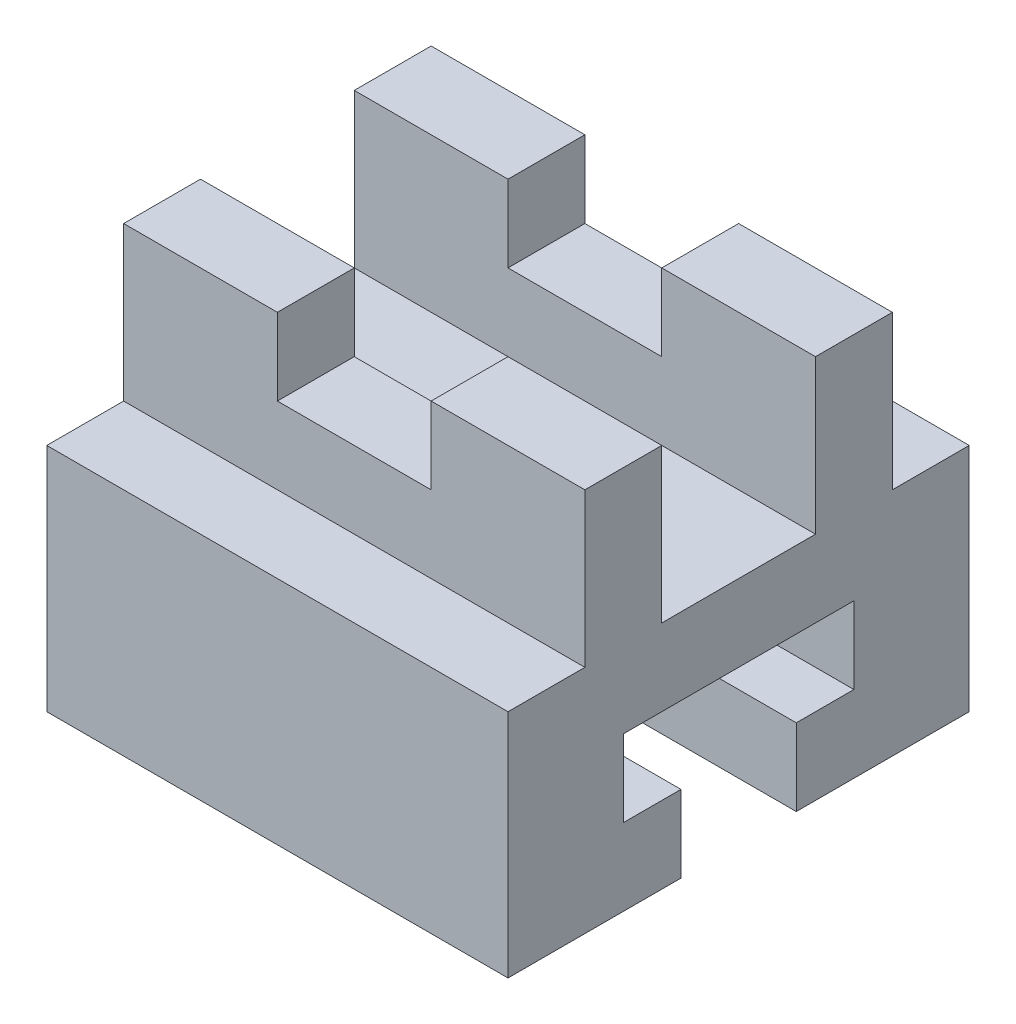
ISO-10303-21;
HEADER;
FILE_DESCRIPTION(('STEP AP214'),'2;1');
FILE_NAME('part.step','',(''),(''),'','','');
FILE_SCHEMA(('AUTOMOTIVE_DESIGN { 1 0 10303 214 1 1 1 1 }'));
ENDSEC;
DATA;
#1=APPLICATION_CONTEXT('core data for automotive mechanical design processes');
#2=APPLICATION_PROTOCOL_DEFINITION('international standard','automotive_design',2000,#1);
#3=PRODUCT_CONTEXT('',#1,'mechanical');
#4=PRODUCT('Part','Part','',(#3));
#5=PRODUCT_RELATED_PRODUCT_CATEGORY('part','',(#4));
#6=PRODUCT_DEFINITION_FORMATION('','',#4);
#7=PRODUCT_DEFINITION_CONTEXT('part definition',#1,'design');
#8=PRODUCT_DEFINITION('design','',#6,#7);
#9=PRODUCT_DEFINITION_SHAPE('','',#8);
#10=(LENGTH_UNIT() NAMED_UNIT(*) SI_UNIT(.MILLI.,.METRE.));
#11=(NAMED_UNIT(*) PLANE_ANGLE_UNIT() SI_UNIT($,.RADIAN.));
#12=(NAMED_UNIT(*) SI_UNIT($,.STERADIAN.) SOLID_ANGLE_UNIT());
#13=UNCERTAINTY_MEASURE_WITH_UNIT(LENGTH_MEASURE(1.E-05),#10,'distance_accuracy_value','');
#14=(GEOMETRIC_REPRESENTATION_CONTEXT(3) GLOBAL_UNCERTAINTY_ASSIGNED_CONTEXT((#13)) GLOBAL_UNIT_ASSIGNED_CONTEXT((#10,
#11,#12)) REPRESENTATION_CONTEXT('',''));
#15=CARTESIAN_POINT('',(0.,0.,0.));
#16=DIRECTION('',(0.,0.,1.));
#17=DIRECTION('',(1.,0.,0.));
#18=AXIS2_PLACEMENT_3D('',#15,#16,#17);
#19=CARTESIAN_POINT('',(32.7027027027027,39.7972972972973,60.));
#20=DIRECTION('',(0.,-1.,0.));
#21=DIRECTION('',(1.,0.,0.));
#22=AXIS2_PLACEMENT_3D('',#19,#20,#21);
#23=PLANE('',#22);
#24=DIRECTION('',(-1.,0.,0.));
#25=VECTOR('',#24,1.);
#26=CARTESIAN_POINT('',(32.7027027027027,39.7972972972973,50.));
#27=LINE('',#26,#25);
#28=CARTESIAN_POINT('',(-7.2972972972973,39.7972972972973,50.));
#29=VERTEX_POINT('',#28);
#30=CARTESIAN_POINT('',(-27.2972972972973,39.7972972972973,50.));
#31=VERTEX_POINT('',#30);
#32=EDGE_CURVE('E441',#29,#31,#27,.T.);
#33=ORIENTED_EDGE('',*,*,#32,.F.);
#34=DIRECTION('',(0.,0.,1.));
#35=VECTOR('',#34,1.);
#36=CARTESIAN_POINT('',(-7.2972972972973,39.7972972972973,9.99999999999999));
#37=LINE('',#36,#35);
#38=CARTESIAN_POINT('',(-7.2972972972973,39.7972972972973,40.));
#39=VERTEX_POINT('',#38);
#40=EDGE_CURVE('E265',#39,#29,#37,.T.);
#41=ORIENTED_EDGE('',*,*,#40,.F.);
#42=DIRECTION('',(-1.,0.,0.));
#43=VECTOR('',#42,1.);
#44=CARTESIAN_POINT('',(32.7027027027027,39.7972972972973,40.));
#45=LINE('',#44,#43);
#46=CARTESIAN_POINT('',(-27.2972972972973,39.7972972972973,40.));
#47=VERTEX_POINT('',#46);
#48=EDGE_CURVE('E314',#39,#47,#45,.T.);
#49=ORIENTED_EDGE('',*,*,#48,.T.);
#50=DIRECTION('',(0.,0.,-1.));
#51=VECTOR('',#50,1.);
#52=CARTESIAN_POINT('',(-27.2972972972973,39.7972972972973,60.));
#53=LINE('',#52,#51);
#54=EDGE_CURVE('E479',#31,#47,#53,.T.);
#55=ORIENTED_EDGE('',*,*,#54,.F.);
#56=EDGE_LOOP('',(#33,#41,#49,#55));
#57=FACE_BOUND('',#56,.T.);
#58=ADVANCED_FACE('F39',(#57),#23,.F.);
#59=DIRECTION('',(-1.,0.,0.));
#60=VECTOR('',#59,1.);
#61=CARTESIAN_POINT('',(32.7027027027027,39.7972972972973,20.));
#62=LINE('',#61,#60);
#63=CARTESIAN_POINT('',(-7.2972972972973,39.7972972972973,20.));
#64=VERTEX_POINT('',#63);
#65=CARTESIAN_POINT('',(-27.2972972972973,39.7972972972973,20.));
#66=VERTEX_POINT('',#65);
#67=EDGE_CURVE('E298',#64,#66,#62,.T.);
#68=ORIENTED_EDGE('',*,*,#67,.F.);
#69=CARTESIAN_POINT('',(-7.2972972972973,39.7972972972973,9.99999999999999));
#70=VERTEX_POINT('',#69);
#71=EDGE_CURVE('E261',#70,#64,#37,.T.);
#72=ORIENTED_EDGE('',*,*,#71,.F.);
#73=DIRECTION('',(-1.,0.,0.));
#74=VECTOR('',#73,1.);
#75=CARTESIAN_POINT('',(32.7027027027027,39.7972972972973,10.));
#76=LINE('',#75,#74);
#77=CARTESIAN_POINT('',(-27.2972972972973,39.7972972972973,10.));
#78=VERTEX_POINT('',#77);
#79=EDGE_CURVE('E245',#70,#78,#76,.T.);
#80=ORIENTED_EDGE('',*,*,#79,.T.);
#81=EDGE_CURVE('E468',#66,#78,#53,.T.);
#82=ORIENTED_EDGE('',*,*,#81,.F.);
#83=EDGE_LOOP('',(#68,#72,#80,#82));
#84=FACE_BOUND('',#83,.T.);
#85=ADVANCED_FACE('F625',(#84),#23,.F.);
#86=CARTESIAN_POINT('',(32.7027027027027,39.7972972972973,40.));
#87=VERTEX_POINT('',#86);
#88=CARTESIAN_POINT('',(12.7027027027027,39.7972972972973,40.));
#89=VERTEX_POINT('',#88);
#90=EDGE_CURVE('E309',#87,#89,#45,.T.);
#91=ORIENTED_EDGE('',*,*,#90,.T.);
#92=DIRECTION('',(0.,0.,1.));
#93=VECTOR('',#92,1.);
#94=CARTESIAN_POINT('',(12.7027027027027,39.7972972972973,9.99999999999999));
#95=LINE('',#94,#93);
#96=CARTESIAN_POINT('',(12.7027027027027,39.7972972972973,50.));
#97=VERTEX_POINT('',#96);
#98=EDGE_CURVE('E270',#89,#97,#95,.T.);
#99=ORIENTED_EDGE('',*,*,#98,.T.);
#100=CARTESIAN_POINT('',(32.7027027027027,39.7972972972973,50.));
#101=VERTEX_POINT('',#100);
#102=EDGE_CURVE('E453',#101,#97,#27,.T.);
#103=ORIENTED_EDGE('',*,*,#102,.F.);
#104=DIRECTION('',(0.,0.,-1.));
#105=VECTOR('',#104,1.);
#106=CARTESIAN_POINT('',(32.7027027027027,39.7972972972973,60.));
#107=LINE('',#106,#105);
#108=EDGE_CURVE('E484',#101,#87,#107,.T.);
#109=ORIENTED_EDGE('',*,*,#108,.T.);
#110=EDGE_LOOP('',(#91,#99,#103,#109));
#111=FACE_BOUND('',#110,.T.);
#112=ADVANCED_FACE('F558',(#111),#23,.F.);
#113=CARTESIAN_POINT('',(-27.2972972972973,-10.2027027027027,60.));
#114=DIRECTION('',(0.,1.,0.));
#115=DIRECTION('',(0.,0.,1.));
#116=AXIS2_PLACEMENT_3D('',#113,#114,#115);
#117=PLANE('',#116);
#118=DIRECTION('',(0.,0.,-1.));
#119=VECTOR('',#118,1.);
#120=CARTESIAN_POINT('',(-27.2972972972973,-10.2027027027027,60.));
#121=LINE('',#120,#119);
#122=CARTESIAN_POINT('',(-27.2972972972973,-10.2027027027027,60.));
#123=VERTEX_POINT('',#122);
#124=CARTESIAN_POINT('',(-27.2972972972973,-10.2027027027027,37.5));
#125=VERTEX_POINT('',#124);
#126=EDGE_CURVE('E494',#123,#125,#121,.T.);
#127=ORIENTED_EDGE('',*,*,#126,.T.);
#128=DIRECTION('',(1.,0.,0.));
#129=VECTOR('',#128,1.);
#130=CARTESIAN_POINT('',(-27.2972972972973,-10.2027027027027,37.5));
#131=LINE('',#130,#129);
#132=CARTESIAN_POINT('',(32.7027027027027,-10.2027027027027,37.5));
#133=VERTEX_POINT('',#132);
#134=EDGE_CURVE('E380',#125,#133,#131,.T.);
#135=ORIENTED_EDGE('',*,*,#134,.T.);
#136=DIRECTION('',(0.,0.,-1.));
#137=VECTOR('',#136,1.);
#138=CARTESIAN_POINT('',(32.7027027027027,-10.2027027027027,60.));
#139=LINE('',#138,#137);
#140=CARTESIAN_POINT('',(32.7027027027027,-10.2027027027027,60.));
#141=VERTEX_POINT('',#140);
#142=EDGE_CURVE('E489',#141,#133,#139,.T.);
#143=ORIENTED_EDGE('',*,*,#142,.F.);
#144=DIRECTION('',(1.,0.,0.));
#145=VECTOR('',#144,1.);
#146=CARTESIAN_POINT('',(-27.2972972972973,-10.2027027027027,60.));
#147=LINE('',#146,#145);
#148=EDGE_CURVE('E460',#123,#141,#147,.T.);
#149=ORIENTED_EDGE('',*,*,#148,.F.);
#150=EDGE_LOOP('',(#127,#135,#143,#149));
#151=FACE_BOUND('',#150,.T.);
#152=ADVANCED_FACE('F585',(#151),#117,.F.);
#153=CARTESIAN_POINT('',(-27.2972972972973,39.7972972972973,60.));
#154=DIRECTION('',(1.,0.,0.));
#155=DIRECTION('',(0.,1.,0.));
#156=AXIS2_PLACEMENT_3D('',#153,#154,#155);
#157=PLANE('',#156);
#158=ORIENTED_EDGE('',*,*,#54,.T.);
#159=DIRECTION('',(0.,1.,0.));
#160=VECTOR('',#159,1.);
#161=CARTESIAN_POINT('',(-27.2972972972973,19.7972972972973,40.));
#162=LINE('',#161,#160);
#163=CARTESIAN_POINT('',(-27.2972972972973,19.7972972972973,40.));
#164=VERTEX_POINT('',#163);
#165=EDGE_CURVE('E290',#164,#47,#162,.T.);
#166=ORIENTED_EDGE('',*,*,#165,.F.);
#167=DIRECTION('',(0.,0.,1.));
#168=VECTOR('',#167,1.);
#169=CARTESIAN_POINT('',(-27.2972972972973,19.7972972972973,20.));
#170=LINE('',#169,#168);
#171=CARTESIAN_POINT('',(-27.2972972972973,19.7972972972973,20.));
#172=VERTEX_POINT('',#171);
#173=EDGE_CURVE('E302',#172,#164,#170,.T.);
#174=ORIENTED_EDGE('',*,*,#173,.F.);
#175=DIRECTION('',(0.,-1.,0.));
#176=VECTOR('',#175,1.);
#177=CARTESIAN_POINT('',(-27.2972972972973,39.7972972972973,20.));
#178=LINE('',#177,#176);
#179=EDGE_CURVE('E284',#66,#172,#178,.T.);
#180=ORIENTED_EDGE('',*,*,#179,.F.);
#181=ORIENTED_EDGE('',*,*,#81,.T.);
#182=DIRECTION('',(0.,1.,0.));
#183=VECTOR('',#182,1.);
#184=CARTESIAN_POINT('',(-27.2972972972973,39.7972972972973,10.));
#185=LINE('',#184,#183);
#186=CARTESIAN_POINT('',(-27.2972972972973,19.7972972972973,10.));
#187=VERTEX_POINT('',#186);
#188=EDGE_CURVE('E410',#187,#78,#185,.T.);
#189=ORIENTED_EDGE('',*,*,#188,.F.);
#190=DIRECTION('',(0.,0.,1.));
#191=VECTOR('',#190,1.);
#192=CARTESIAN_POINT('',(-27.2972972972973,19.7972972972973,10.));
#193=LINE('',#192,#191);
#194=CARTESIAN_POINT('',(-27.2972972972973,19.7972972972973,0.));
#195=VERTEX_POINT('',#194);
#196=EDGE_CURVE('E415',#195,#187,#193,.T.);
#197=ORIENTED_EDGE('',*,*,#196,.F.);
#198=DIRECTION('',(0.,-1.,0.));
#199=VECTOR('',#198,1.);
#200=CARTESIAN_POINT('',(-27.2972972972973,39.7972972972973,0.));
#201=LINE('',#200,#199);
#202=CARTESIAN_POINT('',(-27.2972972972973,-10.2027027027027,0.));
#203=VERTEX_POINT('',#202);
#204=EDGE_CURVE('E426',#195,#203,#201,.T.);
#205=ORIENTED_EDGE('',*,*,#204,.T.);
#206=CARTESIAN_POINT('',(-27.2972972972973,-10.2027027027027,22.5));
#207=VERTEX_POINT('',#206);
#208=EDGE_CURVE('E493',#207,#203,#121,.T.);
#209=ORIENTED_EDGE('',*,*,#208,.F.);
#210=DIRECTION('',(0.,1.,0.));
#211=VECTOR('',#210,1.);
#212=CARTESIAN_POINT('',(-27.2972972972973,-0.2027027027027,22.5));
#213=LINE('',#212,#211);
#214=CARTESIAN_POINT('',(-27.2972972972973,-0.2027027027027,22.5));
#215=VERTEX_POINT('',#214);
#216=EDGE_CURVE('E325',#207,#215,#213,.T.);
#217=ORIENTED_EDGE('',*,*,#216,.T.);
#218=DIRECTION('',(0.,0.,-1.));
#219=VECTOR('',#218,1.);
#220=CARTESIAN_POINT('',(-27.2972972972973,-0.202702702702699,15.));
#221=LINE('',#220,#219);
#222=CARTESIAN_POINT('',(-27.2972972972973,-0.202702702702699,15.));
#223=VERTEX_POINT('',#222);
#224=EDGE_CURVE('E329',#215,#223,#221,.T.);
#225=ORIENTED_EDGE('',*,*,#224,.T.);
#226=DIRECTION('',(0.,1.,0.));
#227=VECTOR('',#226,1.);
#228=CARTESIAN_POINT('',(-27.2972972972973,9.7972972972973,15.));
#229=LINE('',#228,#227);
#230=CARTESIAN_POINT('',(-27.2972972972973,9.7972972972973,15.));
#231=VERTEX_POINT('',#230);
#232=EDGE_CURVE('E334',#223,#231,#229,.T.);
#233=ORIENTED_EDGE('',*,*,#232,.T.);
#234=DIRECTION('',(0.,0.,1.));
#235=VECTOR('',#234,1.);
#236=CARTESIAN_POINT('',(-27.2972972972973,9.7972972972973,45.));
#237=LINE('',#236,#235);
#238=CARTESIAN_POINT('',(-27.2972972972973,9.7972972972973,45.));
#239=VERTEX_POINT('',#238);
#240=EDGE_CURVE('E338',#231,#239,#237,.T.);
#241=ORIENTED_EDGE('',*,*,#240,.T.);
#242=DIRECTION('',(0.,-1.,0.));
#243=VECTOR('',#242,1.);
#244=CARTESIAN_POINT('',(-27.2972972972973,-0.202702702702702,45.));
#245=LINE('',#244,#243);
#246=CARTESIAN_POINT('',(-27.2972972972973,-0.202702702702702,45.));
#247=VERTEX_POINT('',#246);
#248=EDGE_CURVE('E342',#239,#247,#245,.T.);
#249=ORIENTED_EDGE('',*,*,#248,.T.);
#250=DIRECTION('',(0.,0.,-1.));
#251=VECTOR('',#250,1.);
#252=CARTESIAN_POINT('',(-27.2972972972973,-0.202702702702702,37.5));
#253=LINE('',#252,#251);
#254=CARTESIAN_POINT('',(-27.2972972972973,-0.202702702702702,37.5));
#255=VERTEX_POINT('',#254);
#256=EDGE_CURVE('E346',#247,#255,#253,.T.);
#257=ORIENTED_EDGE('',*,*,#256,.T.);
#258=DIRECTION('',(0.,-1.,0.));
#259=VECTOR('',#258,1.);
#260=CARTESIAN_POINT('',(-27.2972972972973,-10.2027027027027,37.5));
#261=LINE('',#260,#259);
#262=EDGE_CURVE('E350',#255,#125,#261,.T.);
#263=ORIENTED_EDGE('',*,*,#262,.T.);
#264=ORIENTED_EDGE('',*,*,#126,.F.);
#265=DIRECTION('',(0.,-1.,0.));
#266=VECTOR('',#265,1.);
#267=CARTESIAN_POINT('',(-27.2972972972973,39.7972972972973,60.));
#268=LINE('',#267,#266);
#269=CARTESIAN_POINT('',(-27.2972972972973,19.7972972972973,60.));
#270=VERTEX_POINT('',#269);
#271=EDGE_CURVE('E457',#270,#123,#268,.T.);
#272=ORIENTED_EDGE('',*,*,#271,.F.);
#273=DIRECTION('',(0.,0.,1.));
#274=VECTOR('',#273,1.);
#275=CARTESIAN_POINT('',(-27.2972972972973,19.7972972972973,50.));
#276=LINE('',#275,#274);
#277=CARTESIAN_POINT('',(-27.2972972972973,19.7972972972973,50.));
#278=VERTEX_POINT('',#277);
#279=EDGE_CURVE('E437',#278,#270,#276,.T.);
#280=ORIENTED_EDGE('',*,*,#279,.F.);
#281=DIRECTION('',(0.,-1.,0.));
#282=VECTOR('',#281,1.);
#283=CARTESIAN_POINT('',(-27.2972972972973,39.7972972972973,50.));
#284=LINE('',#283,#282);
#285=EDGE_CURVE('E384',#31,#278,#284,.T.);
#286=ORIENTED_EDGE('',*,*,#285,.F.);
#287=EDGE_LOOP('',(#158,#166,#174,#180,#181,#189,#197,#205,#209,#217,#225,#233,#241,#249,#257,
#263,#264,#272,#280,#286));
#288=FACE_BOUND('',#287,.T.);
#289=ADVANCED_FACE('F41',(#288),#157,.F.);
#290=CARTESIAN_POINT('',(32.7027027027027,-10.2027027027027,22.5));
#291=VERTEX_POINT('',#290);
#292=CARTESIAN_POINT('',(32.7027027027027,-10.2027027027027,0.));
#293=VERTEX_POINT('',#292);
#294=EDGE_CURVE('E488',#291,#293,#139,.T.);
#295=ORIENTED_EDGE('',*,*,#294,.F.);
#296=DIRECTION('',(1.,0.,0.));
#297=VECTOR('',#296,1.);
#298=CARTESIAN_POINT('',(-27.2972972972973,-10.2027027027027,22.5));
#299=LINE('',#298,#297);
#300=EDGE_CURVE('E354',#207,#291,#299,.T.);
#301=ORIENTED_EDGE('',*,*,#300,.F.);
#302=ORIENTED_EDGE('',*,*,#208,.T.);
#303=DIRECTION('',(1.,0.,0.));
#304=VECTOR('',#303,1.);
#305=CARTESIAN_POINT('',(-27.2972972972973,-10.2027027027027,0.));
#306=LINE('',#305,#304);
#307=EDGE_CURVE('E472',#203,#293,#306,.T.);
#308=ORIENTED_EDGE('',*,*,#307,.T.);
#309=EDGE_LOOP('',(#295,#301,#302,#308));
#310=FACE_BOUND('',#309,.T.);
#311=ADVANCED_FACE('F614',(#310),#117,.F.);
#312=CARTESIAN_POINT('',(32.7027027027027,-10.2027027027027,60.));
#313=DIRECTION('',(-1.,0.,0.));
#314=DIRECTION('',(0.,0.,1.));
#315=AXIS2_PLACEMENT_3D('',#312,#313,#314);
#316=PLANE('',#315);
#317=DIRECTION('',(0.,0.,1.));
#318=VECTOR('',#317,1.);
#319=CARTESIAN_POINT('',(32.7027027027027,19.7972972972973,20.));
#320=LINE('',#319,#318);
#321=CARTESIAN_POINT('',(32.7027027027027,19.7972972972973,20.));
#322=VERTEX_POINT('',#321);
#323=CARTESIAN_POINT('',(32.7027027027027,19.7972972972973,40.));
#324=VERTEX_POINT('',#323);
#325=EDGE_CURVE('E289',#322,#324,#320,.T.);
#326=ORIENTED_EDGE('',*,*,#325,.T.);
#327=DIRECTION('',(0.,1.,0.));
#328=VECTOR('',#327,1.);
#329=CARTESIAN_POINT('',(32.7027027027027,19.7972972972973,40.));
#330=LINE('',#329,#328);
#331=EDGE_CURVE('E294',#324,#87,#330,.T.);
#332=ORIENTED_EDGE('',*,*,#331,.T.);
#333=ORIENTED_EDGE('',*,*,#108,.F.);
#334=DIRECTION('',(0.,-1.,0.));
#335=VECTOR('',#334,1.);
#336=CARTESIAN_POINT('',(32.7027027027027,39.7972972972973,50.));
#337=LINE('',#336,#335);
#338=CARTESIAN_POINT('',(32.7027027027027,19.7972972972973,50.));
#339=VERTEX_POINT('',#338);
#340=EDGE_CURVE('E432',#101,#339,#337,.T.);
#341=ORIENTED_EDGE('',*,*,#340,.T.);
#342=DIRECTION('',(0.,0.,1.));
#343=VECTOR('',#342,1.);
#344=CARTESIAN_POINT('',(32.7027027027027,19.7972972972973,50.));
#345=LINE('',#344,#343);
#346=CARTESIAN_POINT('',(32.7027027027027,19.7972972972973,60.));
#347=VERTEX_POINT('',#346);
#348=EDGE_CURVE('E436',#339,#347,#345,.T.);
#349=ORIENTED_EDGE('',*,*,#348,.T.);
#350=DIRECTION('',(0.,1.,0.));
#351=VECTOR('',#350,1.);
#352=CARTESIAN_POINT('',(32.7027027027027,-10.2027027027027,60.));
#353=LINE('',#352,#351);
#354=EDGE_CURVE('E464',#141,#347,#353,.T.);
#355=ORIENTED_EDGE('',*,*,#354,.F.);
#356=ORIENTED_EDGE('',*,*,#142,.T.);
#357=DIRECTION('',(0.,-1.,0.));
#358=VECTOR('',#357,1.);
#359=CARTESIAN_POINT('',(32.7027027027027,-10.2027027027027,37.5));
#360=LINE('',#359,#358);
#361=CARTESIAN_POINT('',(32.7027027027027,-0.202702702702702,37.5));
#362=VERTEX_POINT('',#361);
#363=EDGE_CURVE('E330',#362,#133,#360,.T.);
#364=ORIENTED_EDGE('',*,*,#363,.F.);
#365=DIRECTION('',(0.,0.,-1.));
#366=VECTOR('',#365,1.);
#367=CARTESIAN_POINT('',(32.7027027027027,-0.202702702702702,37.5));
#368=LINE('',#367,#366);
#369=CARTESIAN_POINT('',(32.7027027027027,-0.202702702702702,45.));
#370=VERTEX_POINT('',#369);
#371=EDGE_CURVE('E374',#370,#362,#368,.T.);
#372=ORIENTED_EDGE('',*,*,#371,.F.);
#373=DIRECTION('',(0.,-1.,0.));
#374=VECTOR('',#373,1.);
#375=CARTESIAN_POINT('',(32.7027027027027,-0.202702702702702,45.));
#376=LINE('',#375,#374);
#377=CARTESIAN_POINT('',(32.7027027027027,9.7972972972973,45.));
#378=VERTEX_POINT('',#377);
#379=EDGE_CURVE('E370',#378,#370,#376,.T.);
#380=ORIENTED_EDGE('',*,*,#379,.F.);
#381=DIRECTION('',(0.,0.,1.));
#382=VECTOR('',#381,1.);
#383=CARTESIAN_POINT('',(32.7027027027027,9.7972972972973,45.));
#384=LINE('',#383,#382);
#385=CARTESIAN_POINT('',(32.7027027027027,9.7972972972973,15.));
#386=VERTEX_POINT('',#385);
#387=EDGE_CURVE('E366',#386,#378,#384,.T.);
#388=ORIENTED_EDGE('',*,*,#387,.F.);
#389=DIRECTION('',(0.,1.,0.));
#390=VECTOR('',#389,1.);
#391=CARTESIAN_POINT('',(32.7027027027027,9.7972972972973,15.));
#392=LINE('',#391,#390);
#393=CARTESIAN_POINT('',(32.7027027027027,-0.202702702702699,15.));
#394=VERTEX_POINT('',#393);
#395=EDGE_CURVE('E362',#394,#386,#392,.T.);
#396=ORIENTED_EDGE('',*,*,#395,.F.);
#397=DIRECTION('',(0.,0.,-1.));
#398=VECTOR('',#397,1.);
#399=CARTESIAN_POINT('',(32.7027027027027,-0.202702702702699,15.));
#400=LINE('',#399,#398);
#401=CARTESIAN_POINT('',(32.7027027027027,-0.2027027027027,22.5));
#402=VERTEX_POINT('',#401);
#403=EDGE_CURVE('E358',#402,#394,#400,.T.);
#404=ORIENTED_EDGE('',*,*,#403,.F.);
#405=DIRECTION('',(0.,1.,0.));
#406=VECTOR('',#405,1.);
#407=CARTESIAN_POINT('',(32.7027027027027,-0.2027027027027,22.5));
#408=LINE('',#407,#406);
#409=EDGE_CURVE('E313',#291,#402,#408,.T.);
#410=ORIENTED_EDGE('',*,*,#409,.F.);
#411=ORIENTED_EDGE('',*,*,#294,.T.);
#412=DIRECTION('',(0.,1.,0.));
#413=VECTOR('',#412,1.);
#414=CARTESIAN_POINT('',(32.7027027027027,-10.2027027027027,0.));
#415=LINE('',#414,#413);
#416=CARTESIAN_POINT('',(32.7027027027027,19.7972972972973,0.));
#417=VERTEX_POINT('',#416);
#418=EDGE_CURVE('E461',#293,#417,#415,.T.);
#419=ORIENTED_EDGE('',*,*,#418,.T.);
#420=DIRECTION('',(0.,0.,1.));
#421=VECTOR('',#420,1.);
#422=CARTESIAN_POINT('',(32.7027027027027,19.7972972972973,10.));
#423=LINE('',#422,#421);
#424=CARTESIAN_POINT('',(32.7027027027027,19.7972972972973,10.));
#425=VERTEX_POINT('',#424);
#426=EDGE_CURVE('E405',#417,#425,#423,.T.);
#427=ORIENTED_EDGE('',*,*,#426,.T.);
#428=DIRECTION('',(0.,1.,0.));
#429=VECTOR('',#428,1.);
#430=CARTESIAN_POINT('',(32.7027027027027,39.7972972972973,10.));
#431=LINE('',#430,#429);
#432=CARTESIAN_POINT('',(32.7027027027027,39.7972972972973,10.));
#433=VERTEX_POINT('',#432);
#434=EDGE_CURVE('E409',#425,#433,#431,.T.);
#435=ORIENTED_EDGE('',*,*,#434,.T.);
#436=CARTESIAN_POINT('',(32.7027027027027,39.7972972972973,20.));
#437=VERTEX_POINT('',#436);
#438=EDGE_CURVE('E483',#437,#433,#107,.T.);
#439=ORIENTED_EDGE('',*,*,#438,.F.);
#440=DIRECTION('',(0.,-1.,0.));
#441=VECTOR('',#440,1.);
#442=CARTESIAN_POINT('',(32.7027027027027,39.7972972972973,20.));
#443=LINE('',#442,#441);
#444=EDGE_CURVE('E285',#437,#322,#443,.T.);
#445=ORIENTED_EDGE('',*,*,#444,.T.);
#446=EDGE_LOOP('',(#326,#332,#333,#341,#349,#355,#356,#364,#372,#380,#388,#396,#404,#410,#411,
#419,#427,#435,#439,#445));
#447=FACE_BOUND('',#446,.T.);
#448=ADVANCED_FACE('F513',(#447),#316,.F.);
#449=CARTESIAN_POINT('',(12.7027027027027,39.7972972972973,9.99999999999999));
#450=VERTEX_POINT('',#449);
#451=EDGE_CURVE('E422',#433,#450,#76,.T.);
#452=ORIENTED_EDGE('',*,*,#451,.T.);
#453=CARTESIAN_POINT('',(12.7027027027027,39.7972972972973,20.));
#454=VERTEX_POINT('',#453);
#455=EDGE_CURVE('E266',#450,#454,#95,.T.);
#456=ORIENTED_EDGE('',*,*,#455,.T.);
#457=EDGE_CURVE('E321',#437,#454,#62,.T.);
#458=ORIENTED_EDGE('',*,*,#457,.F.);
#459=ORIENTED_EDGE('',*,*,#438,.T.);
#460=EDGE_LOOP('',(#452,#456,#458,#459));
#461=FACE_BOUND('',#460,.T.);
#462=ADVANCED_FACE('F508',(#461),#23,.F.);
#463=CARTESIAN_POINT('',(0.,0.,60.));
#464=DIRECTION('',(0.,0.,1.));
#465=DIRECTION('',(1.,0.,0.));
#466=AXIS2_PLACEMENT_3D('',#463,#464,#465);
#467=PLANE('',#466);
#468=DIRECTION('',(-1.,0.,0.));
#469=VECTOR('',#468,1.);
#470=CARTESIAN_POINT('',(32.7027027027027,19.7972972972973,60.));
#471=LINE('',#470,#469);
#472=EDGE_CURVE('E419',#347,#270,#471,.T.);
#473=ORIENTED_EDGE('',*,*,#472,.T.);
#474=ORIENTED_EDGE('',*,*,#271,.T.);
#475=ORIENTED_EDGE('',*,*,#148,.T.);
#476=ORIENTED_EDGE('',*,*,#354,.T.);
#477=EDGE_LOOP('',(#473,#474,#475,#476));
#478=FACE_BOUND('',#477,.T.);
#479=ADVANCED_FACE('F578',(#478),#467,.T.);
#480=CARTESIAN_POINT('',(0.,0.,0.));
#481=DIRECTION('',(0.,0.,1.));
#482=DIRECTION('',(1.,0.,0.));
#483=AXIS2_PLACEMENT_3D('',#480,#481,#482);
#484=PLANE('',#483);
#485=ORIENTED_EDGE('',*,*,#204,.F.);
#486=DIRECTION('',(-1.,0.,0.));
#487=VECTOR('',#486,1.);
#488=CARTESIAN_POINT('',(32.7027027027027,19.7972972972973,0.));
#489=LINE('',#488,#487);
#490=EDGE_CURVE('E414',#417,#195,#489,.T.);
#491=ORIENTED_EDGE('',*,*,#490,.F.);
#492=ORIENTED_EDGE('',*,*,#418,.F.);
#493=ORIENTED_EDGE('',*,*,#307,.F.);
#494=EDGE_LOOP('',(#485,#491,#492,#493));
#495=FACE_BOUND('',#494,.T.);
#496=ADVANCED_FACE('F521',(#495),#484,.F.);
#497=CARTESIAN_POINT('',(32.7027027027027,39.7972972972973,10.));
#498=DIRECTION('',(0.,0.,1.));
#499=DIRECTION('',(0.,-1.,0.));
#500=AXIS2_PLACEMENT_3D('',#497,#498,#499);
#501=PLANE('',#500);
#502=ORIENTED_EDGE('',*,*,#79,.F.);
#503=DIRECTION('',(0.,-1.,0.));
#504=VECTOR('',#503,1.);
#505=CARTESIAN_POINT('',(-7.2972972972973,29.7972972972973,9.99999999999999));
#506=LINE('',#505,#504);
#507=CARTESIAN_POINT('',(-7.2972972972973,29.7972972972973,9.99999999999999));
#508=VERTEX_POINT('',#507);
#509=EDGE_CURVE('E225',#70,#508,#506,.T.);
#510=ORIENTED_EDGE('',*,*,#509,.T.);
#511=DIRECTION('',(1.,0.,0.));
#512=VECTOR('',#511,1.);
#513=CARTESIAN_POINT('',(12.7027027027027,29.7972972972973,9.99999999999999));
#514=LINE('',#513,#512);
#515=CARTESIAN_POINT('',(12.7027027027027,29.7972972972973,9.99999999999999));
#516=VERTEX_POINT('',#515);
#517=EDGE_CURVE('E232',#508,#516,#514,.T.);
#518=ORIENTED_EDGE('',*,*,#517,.T.);
#519=DIRECTION('',(0.,1.,0.));
#520=VECTOR('',#519,1.);
#521=CARTESIAN_POINT('',(12.7027027027027,39.7972972972973,9.99999999999999));
#522=LINE('',#521,#520);
#523=EDGE_CURVE('E240',#516,#450,#522,.T.);
#524=ORIENTED_EDGE('',*,*,#523,.T.);
#525=ORIENTED_EDGE('',*,*,#451,.F.);
#526=ORIENTED_EDGE('',*,*,#434,.F.);
#527=DIRECTION('',(-1.,0.,0.));
#528=VECTOR('',#527,1.);
#529=CARTESIAN_POINT('',(32.7027027027027,19.7972972972973,10.));
#530=LINE('',#529,#528);
#531=EDGE_CURVE('E427',#425,#187,#530,.T.);
#532=ORIENTED_EDGE('',*,*,#531,.T.);
#533=ORIENTED_EDGE('',*,*,#188,.T.);
#534=EDGE_LOOP('',(#502,#510,#518,#524,#525,#526,#532,#533));
#535=FACE_BOUND('',#534,.T.);
#536=ADVANCED_FACE('F243',(#535),#501,.F.);
#537=CARTESIAN_POINT('',(32.7027027027027,19.7972972972973,10.));
#538=DIRECTION('',(0.,-1.,0.));
#539=DIRECTION('',(0.,0.,-1.));
#540=AXIS2_PLACEMENT_3D('',#537,#538,#539);
#541=PLANE('',#540);
#542=ORIENTED_EDGE('',*,*,#196,.T.);
#543=ORIENTED_EDGE('',*,*,#531,.F.);
#544=ORIENTED_EDGE('',*,*,#426,.F.);
#545=ORIENTED_EDGE('',*,*,#490,.T.);
#546=EDGE_LOOP('',(#542,#543,#544,#545));
#547=FACE_BOUND('',#546,.T.);
#548=ADVANCED_FACE('F517',(#547),#541,.F.);
#549=CARTESIAN_POINT('',(32.7027027027027,19.7972972972973,50.));
#550=DIRECTION('',(0.,-1.,0.));
#551=DIRECTION('',(1.,0.,0.));
#552=AXIS2_PLACEMENT_3D('',#549,#550,#551);
#553=PLANE('',#552);
#554=ORIENTED_EDGE('',*,*,#279,.T.);
#555=ORIENTED_EDGE('',*,*,#472,.F.);
#556=ORIENTED_EDGE('',*,*,#348,.F.);
#557=DIRECTION('',(-1.,0.,0.));
#558=VECTOR('',#557,1.);
#559=CARTESIAN_POINT('',(32.7027027027027,19.7972972972973,50.));
#560=LINE('',#559,#558);
#561=EDGE_CURVE('E450',#339,#278,#560,.T.);
#562=ORIENTED_EDGE('',*,*,#561,.T.);
#563=EDGE_LOOP('',(#554,#555,#556,#562));
#564=FACE_BOUND('',#563,.T.);
#565=ADVANCED_FACE('F576',(#564),#553,.F.);
#566=CARTESIAN_POINT('',(32.7027027027027,39.7972972972973,50.));
#567=DIRECTION('',(0.,0.,-1.));
#568=DIRECTION('',(-1.,0.,0.));
#569=AXIS2_PLACEMENT_3D('',#566,#567,#568);
#570=PLANE('',#569);
#571=DIRECTION('',(1.,0.,0.));
#572=VECTOR('',#571,1.);
#573=CARTESIAN_POINT('',(12.7027027027027,29.7972972972973,50.));
#574=LINE('',#573,#572);
#575=CARTESIAN_POINT('',(-7.2972972972973,29.7972972972973,50.));
#576=VERTEX_POINT('',#575);
#577=CARTESIAN_POINT('',(12.7027027027027,29.7972972972973,50.));
#578=VERTEX_POINT('',#577);
#579=EDGE_CURVE('E250',#576,#578,#574,.T.);
#580=ORIENTED_EDGE('',*,*,#579,.F.);
#581=DIRECTION('',(0.,-1.,0.));
#582=VECTOR('',#581,1.);
#583=CARTESIAN_POINT('',(-7.2972972972973,29.7972972972973,50.));
#584=LINE('',#583,#582);
#585=EDGE_CURVE('E255',#29,#576,#584,.T.);
#586=ORIENTED_EDGE('',*,*,#585,.F.);
#587=ORIENTED_EDGE('',*,*,#32,.T.);
#588=ORIENTED_EDGE('',*,*,#285,.T.);
#589=ORIENTED_EDGE('',*,*,#561,.F.);
#590=ORIENTED_EDGE('',*,*,#340,.F.);
#591=ORIENTED_EDGE('',*,*,#102,.T.);
#592=DIRECTION('',(0.,1.,0.));
#593=VECTOR('',#592,1.);
#594=CARTESIAN_POINT('',(12.7027027027027,39.7972972972973,50.));
#595=LINE('',#594,#593);
#596=EDGE_CURVE('E247',#578,#97,#595,.T.);
#597=ORIENTED_EDGE('',*,*,#596,.F.);
#598=EDGE_LOOP('',(#580,#586,#587,#588,#589,#590,#591,#597));
#599=FACE_BOUND('',#598,.T.);
#600=ADVANCED_FACE('F553',(#599),#570,.F.);
#601=CARTESIAN_POINT('',(-27.2972972972973,-10.2027027027027,37.5));
#602=DIRECTION('',(0.,0.,1.));
#603=DIRECTION('',(1.,0.,0.));
#604=AXIS2_PLACEMENT_3D('',#601,#602,#603);
#605=PLANE('',#604);
#606=ORIENTED_EDGE('',*,*,#363,.T.);
#607=ORIENTED_EDGE('',*,*,#134,.F.);
#608=ORIENTED_EDGE('',*,*,#262,.F.);
#609=DIRECTION('',(1.,0.,0.));
#610=VECTOR('',#609,1.);
#611=CARTESIAN_POINT('',(-27.2972972972973,-0.202702702702702,37.5));
#612=LINE('',#611,#610);
#613=EDGE_CURVE('E385',#255,#362,#612,.T.);
#614=ORIENTED_EDGE('',*,*,#613,.T.);
#615=EDGE_LOOP('',(#606,#607,#608,#614));
#616=FACE_BOUND('',#615,.T.);
#617=ADVANCED_FACE('F588',(#616),#605,.F.);
#618=CARTESIAN_POINT('',(-27.2972972972973,-0.202702702702702,37.5));
#619=DIRECTION('',(0.,-1.,0.));
#620=DIRECTION('',(0.,0.,-1.));
#621=AXIS2_PLACEMENT_3D('',#618,#619,#620);
#622=PLANE('',#621);
#623=ORIENTED_EDGE('',*,*,#371,.T.);
#624=ORIENTED_EDGE('',*,*,#613,.F.);
#625=ORIENTED_EDGE('',*,*,#256,.F.);
#626=DIRECTION('',(1.,0.,0.));
#627=VECTOR('',#626,1.);
#628=CARTESIAN_POINT('',(-27.2972972972973,-0.202702702702702,45.));
#629=LINE('',#628,#627);
#630=EDGE_CURVE('E388',#247,#370,#629,.T.);
#631=ORIENTED_EDGE('',*,*,#630,.T.);
#632=EDGE_LOOP('',(#623,#624,#625,#631));
#633=FACE_BOUND('',#632,.T.);
#634=ADVANCED_FACE('F592',(#633),#622,.F.);
#635=CARTESIAN_POINT('',(-27.2972972972973,-0.202702702702702,45.));
#636=DIRECTION('',(0.,0.,1.));
#637=DIRECTION('',(1.,0.,0.));
#638=AXIS2_PLACEMENT_3D('',#635,#636,#637);
#639=PLANE('',#638);
#640=ORIENTED_EDGE('',*,*,#379,.T.);
#641=ORIENTED_EDGE('',*,*,#630,.F.);
#642=ORIENTED_EDGE('',*,*,#248,.F.);
#643=DIRECTION('',(1.,0.,0.));
#644=VECTOR('',#643,1.);
#645=CARTESIAN_POINT('',(-27.2972972972973,9.7972972972973,45.));
#646=LINE('',#645,#644);
#647=EDGE_CURVE('E391',#239,#378,#646,.T.);
#648=ORIENTED_EDGE('',*,*,#647,.T.);
#649=EDGE_LOOP('',(#640,#641,#642,#648));
#650=FACE_BOUND('',#649,.T.);
#651=ADVANCED_FACE('F597',(#650),#639,.F.);
#652=CARTESIAN_POINT('',(-27.2972972972973,9.7972972972973,45.));
#653=DIRECTION('',(0.,1.,0.));
#654=DIRECTION('',(0.,0.,1.));
#655=AXIS2_PLACEMENT_3D('',#652,#653,#654);
#656=PLANE('',#655);
#657=ORIENTED_EDGE('',*,*,#387,.T.);
#658=ORIENTED_EDGE('',*,*,#647,.F.);
#659=ORIENTED_EDGE('',*,*,#240,.F.);
#660=DIRECTION('',(1.,0.,0.));
#661=VECTOR('',#660,1.);
#662=CARTESIAN_POINT('',(-27.2972972972973,9.7972972972973,15.));
#663=LINE('',#662,#661);
#664=EDGE_CURVE('E394',#231,#386,#663,.T.);
#665=ORIENTED_EDGE('',*,*,#664,.T.);
#666=EDGE_LOOP('',(#657,#658,#659,#665));
#667=FACE_BOUND('',#666,.T.);
#668=ADVANCED_FACE('F600',(#667),#656,.F.);
#669=CARTESIAN_POINT('',(-27.2972972972973,9.7972972972973,15.));
#670=DIRECTION('',(0.,0.,-1.));
#671=DIRECTION('',(0.,1.,0.));
#672=AXIS2_PLACEMENT_3D('',#669,#670,#671);
#673=PLANE('',#672);
#674=ORIENTED_EDGE('',*,*,#395,.T.);
#675=ORIENTED_EDGE('',*,*,#664,.F.);
#676=ORIENTED_EDGE('',*,*,#232,.F.);
#677=DIRECTION('',(1.,0.,0.));
#678=VECTOR('',#677,1.);
#679=CARTESIAN_POINT('',(-27.2972972972973,-0.202702702702699,15.));
#680=LINE('',#679,#678);
#681=EDGE_CURVE('E397',#223,#394,#680,.T.);
#682=ORIENTED_EDGE('',*,*,#681,.T.);
#683=EDGE_LOOP('',(#674,#675,#676,#682));
#684=FACE_BOUND('',#683,.T.);
#685=ADVANCED_FACE('F603',(#684),#673,.F.);
#686=CARTESIAN_POINT('',(-27.2972972972973,-0.202702702702699,15.));
#687=DIRECTION('',(0.,-1.,0.));
#688=DIRECTION('',(0.,0.,-1.));
#689=AXIS2_PLACEMENT_3D('',#686,#687,#688);
#690=PLANE('',#689);
#691=ORIENTED_EDGE('',*,*,#403,.T.);
#692=ORIENTED_EDGE('',*,*,#681,.F.);
#693=ORIENTED_EDGE('',*,*,#224,.F.);
#694=DIRECTION('',(1.,0.,0.));
#695=VECTOR('',#694,1.);
#696=CARTESIAN_POINT('',(-27.2972972972973,-0.2027027027027,22.5));
#697=LINE('',#696,#695);
#698=EDGE_CURVE('E400',#215,#402,#697,.T.);
#699=ORIENTED_EDGE('',*,*,#698,.T.);
#700=EDGE_LOOP('',(#691,#692,#693,#699));
#701=FACE_BOUND('',#700,.T.);
#702=ADVANCED_FACE('F608',(#701),#690,.F.);
#703=CARTESIAN_POINT('',(-27.2972972972973,-0.2027027027027,22.5));
#704=DIRECTION('',(0.,0.,-1.));
#705=DIRECTION('',(-1.,0.,0.));
#706=AXIS2_PLACEMENT_3D('',#703,#704,#705);
#707=PLANE('',#706);
#708=ORIENTED_EDGE('',*,*,#409,.T.);
#709=ORIENTED_EDGE('',*,*,#698,.F.);
#710=ORIENTED_EDGE('',*,*,#216,.F.);
#711=ORIENTED_EDGE('',*,*,#300,.T.);
#712=EDGE_LOOP('',(#708,#709,#710,#711));
#713=FACE_BOUND('',#712,.T.);
#714=ADVANCED_FACE('F611',(#713),#707,.F.);
#715=CARTESIAN_POINT('',(32.7027027027027,19.7972972972973,40.));
#716=DIRECTION('',(0.,0.,1.));
#717=DIRECTION('',(1.,0.,0.));
#718=AXIS2_PLACEMENT_3D('',#715,#716,#717);
#719=PLANE('',#718);
#720=ORIENTED_EDGE('',*,*,#48,.F.);
#721=DIRECTION('',(0.,-1.,0.));
#722=VECTOR('',#721,1.);
#723=CARTESIAN_POINT('',(-7.2972972972973,19.7972972972973,40.));
#724=LINE('',#723,#722);
#725=CARTESIAN_POINT('',(-7.2972972972973,29.7972972972973,40.));
#726=VERTEX_POINT('',#725);
#727=EDGE_CURVE('E280',#39,#726,#724,.T.);
#728=ORIENTED_EDGE('',*,*,#727,.T.);
#729=DIRECTION('',(1.,0.,0.));
#730=VECTOR('',#729,1.);
#731=CARTESIAN_POINT('',(32.7027027027027,29.7972972972973,40.));
#732=LINE('',#731,#730);
#733=CARTESIAN_POINT('',(12.7027027027027,29.7972972972973,40.));
#734=VERTEX_POINT('',#733);
#735=EDGE_CURVE('E264',#726,#734,#732,.T.);
#736=ORIENTED_EDGE('',*,*,#735,.T.);
#737=DIRECTION('',(0.,1.,0.));
#738=VECTOR('',#737,1.);
#739=CARTESIAN_POINT('',(12.7027027027027,19.7972972972973,40.));
#740=LINE('',#739,#738);
#741=EDGE_CURVE('E276',#734,#89,#740,.T.);
#742=ORIENTED_EDGE('',*,*,#741,.T.);
#743=ORIENTED_EDGE('',*,*,#90,.F.);
#744=ORIENTED_EDGE('',*,*,#331,.F.);
#745=DIRECTION('',(-1.,0.,0.));
#746=VECTOR('',#745,1.);
#747=CARTESIAN_POINT('',(32.7027027027027,19.7972972972973,40.));
#748=LINE('',#747,#746);
#749=EDGE_CURVE('E315',#324,#164,#748,.T.);
#750=ORIENTED_EDGE('',*,*,#749,.T.);
#751=ORIENTED_EDGE('',*,*,#165,.T.);
#752=EDGE_LOOP('',(#720,#728,#736,#742,#743,#744,#750,#751));
#753=FACE_BOUND('',#752,.T.);
#754=ADVANCED_FACE('F563',(#753),#719,.F.);
#755=CARTESIAN_POINT('',(32.7027027027027,19.7972972972973,20.));
#756=DIRECTION('',(0.,-1.,0.));
#757=DIRECTION('',(0.,0.,-1.));
#758=AXIS2_PLACEMENT_3D('',#755,#756,#757);
#759=PLANE('',#758);
#760=ORIENTED_EDGE('',*,*,#173,.T.);
#761=ORIENTED_EDGE('',*,*,#749,.F.);
#762=ORIENTED_EDGE('',*,*,#325,.F.);
#763=DIRECTION('',(-1.,0.,0.));
#764=VECTOR('',#763,1.);
#765=CARTESIAN_POINT('',(32.7027027027027,19.7972972972973,20.));
#766=LINE('',#765,#764);
#767=EDGE_CURVE('E318',#322,#172,#766,.T.);
#768=ORIENTED_EDGE('',*,*,#767,.T.);
#769=EDGE_LOOP('',(#760,#761,#762,#768));
#770=FACE_BOUND('',#769,.T.);
#771=ADVANCED_FACE('F566',(#770),#759,.F.);
#772=CARTESIAN_POINT('',(32.7027027027027,39.7972972972973,20.));
#773=DIRECTION('',(0.,0.,-1.));
#774=DIRECTION('',(0.,1.,0.));
#775=AXIS2_PLACEMENT_3D('',#772,#773,#774);
#776=PLANE('',#775);
#777=DIRECTION('',(-1.,0.,0.));
#778=VECTOR('',#777,1.);
#779=CARTESIAN_POINT('',(32.7027027027027,29.7972972972973,20.));
#780=LINE('',#779,#778);
#781=CARTESIAN_POINT('',(12.7027027027027,29.7972972972973,20.));
#782=VERTEX_POINT('',#781);
#783=CARTESIAN_POINT('',(-7.2972972972973,29.7972972972973,20.));
#784=VERTEX_POINT('',#783);
#785=EDGE_CURVE('E498',#782,#784,#780,.T.);
#786=ORIENTED_EDGE('',*,*,#785,.T.);
#787=DIRECTION('',(0.,1.,0.));
#788=VECTOR('',#787,1.);
#789=CARTESIAN_POINT('',(-7.2972972972973,39.7972972972973,20.));
#790=LINE('',#789,#788);
#791=EDGE_CURVE('E11',#784,#64,#790,.T.);
#792=ORIENTED_EDGE('',*,*,#791,.T.);
#793=ORIENTED_EDGE('',*,*,#67,.T.);
#794=ORIENTED_EDGE('',*,*,#179,.T.);
#795=ORIENTED_EDGE('',*,*,#767,.F.);
#796=ORIENTED_EDGE('',*,*,#444,.F.);
#797=ORIENTED_EDGE('',*,*,#457,.T.);
#798=DIRECTION('',(0.,-1.,0.));
#799=VECTOR('',#798,1.);
#800=CARTESIAN_POINT('',(12.7027027027027,39.7972972972973,20.));
#801=LINE('',#800,#799);
#802=EDGE_CURVE('E48',#454,#782,#801,.T.);
#803=ORIENTED_EDGE('',*,*,#802,.T.);
#804=EDGE_LOOP('',(#786,#792,#793,#794,#795,#796,#797,#803));
#805=FACE_BOUND('',#804,.T.);
#806=ADVANCED_FACE('F503',(#805),#776,.F.);
#807=CARTESIAN_POINT('',(12.7027027027027,29.7972972972973,9.99999999999999));
#808=DIRECTION('',(0.,-1.,0.));
#809=DIRECTION('',(1.,0.,0.));
#810=AXIS2_PLACEMENT_3D('',#807,#808,#809);
#811=PLANE('',#810);
#812=DIRECTION('',(0.,0.,1.));
#813=VECTOR('',#812,1.);
#814=CARTESIAN_POINT('',(12.7027027027027,29.7972972972973,9.99999999999999));
#815=LINE('',#814,#813);
#816=EDGE_CURVE('E235',#516,#782,#815,.T.);
#817=ORIENTED_EDGE('',*,*,#816,.F.);
#818=ORIENTED_EDGE('',*,*,#517,.F.);
#819=DIRECTION('',(0.,0.,1.));
#820=VECTOR('',#819,1.);
#821=CARTESIAN_POINT('',(-7.2972972972973,29.7972972972973,9.99999999999999));
#822=LINE('',#821,#820);
#823=EDGE_CURVE('E63',#508,#784,#822,.T.);
#824=ORIENTED_EDGE('',*,*,#823,.T.);
#825=ORIENTED_EDGE('',*,*,#785,.F.);
#826=EDGE_LOOP('',(#817,#818,#824,#825));
#827=FACE_BOUND('',#826,.T.);
#828=ADVANCED_FACE('F233',(#827),#811,.F.);
#829=CARTESIAN_POINT('',(12.7027027027027,39.7972972972973,9.99999999999999));
#830=DIRECTION('',(1.,0.,0.));
#831=DIRECTION('',(0.,1.,0.));
#832=AXIS2_PLACEMENT_3D('',#829,#830,#831);
#833=PLANE('',#832);
#834=ORIENTED_EDGE('',*,*,#455,.F.);
#835=ORIENTED_EDGE('',*,*,#523,.F.);
#836=ORIENTED_EDGE('',*,*,#816,.T.);
#837=ORIENTED_EDGE('',*,*,#802,.F.);
#838=EDGE_LOOP('',(#834,#835,#836,#837));
#839=FACE_BOUND('',#838,.T.);
#840=ADVANCED_FACE('F506',(#839),#833,.F.);
#841=CARTESIAN_POINT('',(-7.2972972972973,29.7972972972973,9.99999999999999));
#842=DIRECTION('',(-1.,0.,0.));
#843=DIRECTION('',(0.,0.,1.));
#844=AXIS2_PLACEMENT_3D('',#841,#842,#843);
#845=PLANE('',#844);
#846=ORIENTED_EDGE('',*,*,#823,.F.);
#847=ORIENTED_EDGE('',*,*,#509,.F.);
#848=ORIENTED_EDGE('',*,*,#71,.T.);
#849=ORIENTED_EDGE('',*,*,#791,.F.);
#850=EDGE_LOOP('',(#846,#847,#848,#849));
#851=FACE_BOUND('',#850,.T.);
#852=ADVANCED_FACE('F223',(#851),#845,.F.);
#853=ORIENTED_EDGE('',*,*,#40,.T.);
#854=ORIENTED_EDGE('',*,*,#585,.T.);
#855=EDGE_CURVE('E229',#726,#576,#822,.T.);
#856=ORIENTED_EDGE('',*,*,#855,.F.);
#857=ORIENTED_EDGE('',*,*,#727,.F.);
#858=EDGE_LOOP('',(#853,#854,#856,#857));
#859=FACE_BOUND('',#858,.T.);
#860=ADVANCED_FACE('F549',(#859),#845,.F.);
#861=EDGE_CURVE('E55',#734,#578,#815,.T.);
#862=ORIENTED_EDGE('',*,*,#861,.T.);
#863=ORIENTED_EDGE('',*,*,#596,.T.);
#864=ORIENTED_EDGE('',*,*,#98,.F.);
#865=ORIENTED_EDGE('',*,*,#741,.F.);
#866=EDGE_LOOP('',(#862,#863,#864,#865));
#867=FACE_BOUND('',#866,.T.);
#868=ADVANCED_FACE('F556',(#867),#833,.F.);
#869=ORIENTED_EDGE('',*,*,#855,.T.);
#870=ORIENTED_EDGE('',*,*,#579,.T.);
#871=ORIENTED_EDGE('',*,*,#861,.F.);
#872=ORIENTED_EDGE('',*,*,#735,.F.);
#873=EDGE_LOOP('',(#869,#870,#871,#872));
#874=FACE_BOUND('',#873,.T.);
#875=ADVANCED_FACE('F544',(#874),#811,.F.);
#876=CLOSED_SHELL('',(#58,#85,#112,#152,#289,#311,#448,#462,#479,#496,#536,#548,#565,#600,#617,
#634,#651,#668,#685,#702,#714,#754,#771,#806,#828,#840,#852,#860,#868,#875));
#877=MANIFOLD_SOLID_BREP('B2',#876);
#878=ADVANCED_BREP_SHAPE_REPRESENTATION('',(#18,#877),#14);
#879=SHAPE_DEFINITION_REPRESENTATION(#9,#878);
ENDSEC;
END-ISO-10303-21;
